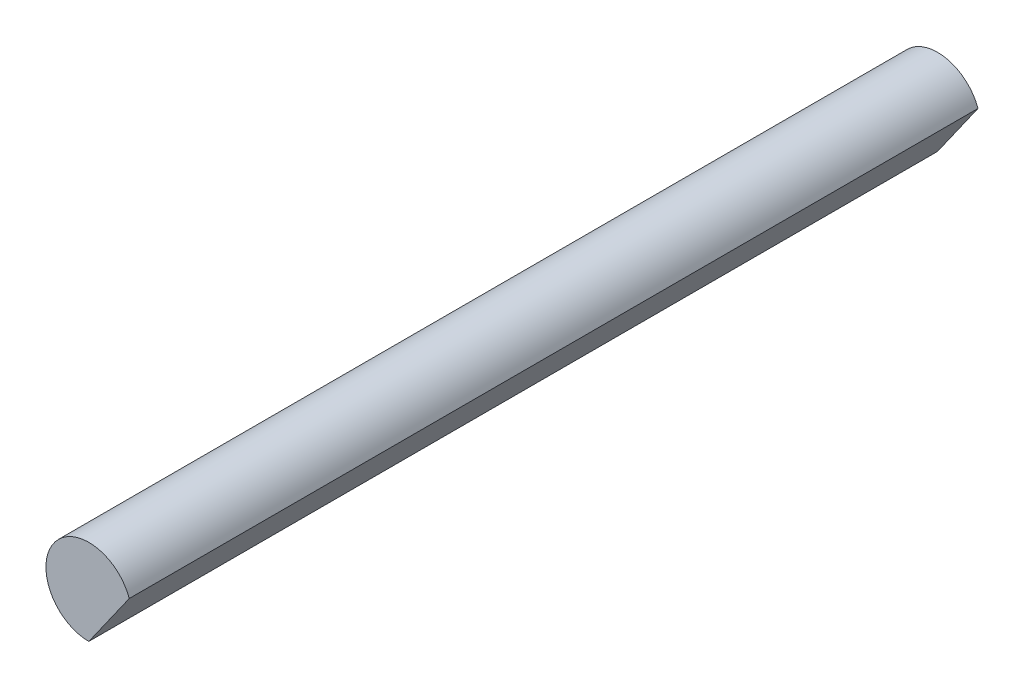
ISO-10303-21;
HEADER;
FILE_DESCRIPTION(('STEP AP214'),'2;1');
FILE_NAME('part.step','',(''),(''),'','','');
FILE_SCHEMA(('AUTOMOTIVE_DESIGN { 1 0 10303 214 1 1 1 1 }'));
ENDSEC;
DATA;
#1=APPLICATION_CONTEXT('core data for automotive mechanical design processes');
#2=APPLICATION_PROTOCOL_DEFINITION('international standard','automotive_design',2000,#1);
#3=PRODUCT_CONTEXT('',#1,'mechanical');
#4=PRODUCT('Part','Part','',(#3));
#5=PRODUCT_RELATED_PRODUCT_CATEGORY('part','',(#4));
#6=PRODUCT_DEFINITION_FORMATION('','',#4);
#7=PRODUCT_DEFINITION_CONTEXT('part definition',#1,'design');
#8=PRODUCT_DEFINITION('design','',#6,#7);
#9=PRODUCT_DEFINITION_SHAPE('','',#8);
#10=(LENGTH_UNIT() NAMED_UNIT(*) SI_UNIT(.MILLI.,.METRE.));
#11=(NAMED_UNIT(*) PLANE_ANGLE_UNIT() SI_UNIT($,.RADIAN.));
#12=(NAMED_UNIT(*) SI_UNIT($,.STERADIAN.) SOLID_ANGLE_UNIT());
#13=UNCERTAINTY_MEASURE_WITH_UNIT(LENGTH_MEASURE(1.E-05),#10,'distance_accuracy_value','');
#14=(GEOMETRIC_REPRESENTATION_CONTEXT(3) GLOBAL_UNCERTAINTY_ASSIGNED_CONTEXT((#13)) GLOBAL_UNIT_ASSIGNED_CONTEXT((#10,
#11,#12)) REPRESENTATION_CONTEXT('',''));
#15=CARTESIAN_POINT('',(0.,0.,0.));
#16=DIRECTION('',(0.,0.,1.));
#17=DIRECTION('',(1.,0.,0.));
#18=AXIS2_PLACEMENT_3D('',#15,#16,#17);
#19=CARTESIAN_POINT('',(0.,0.,33.840801313614));
#20=DIRECTION('',(0.,0.,-1.));
#21=DIRECTION('',(-1.,0.,0.));
#22=AXIS2_PLACEMENT_3D('',#19,#20,#21);
#23=CYLINDRICAL_SURFACE('',#22,1.5);
#24=CARTESIAN_POINT('',(0.,0.,29.66));
#25=DIRECTION('',(0.,0.,1.));
#26=DIRECTION('',(1.,0.,0.));
#27=AXIS2_PLACEMENT_3D('',#24,#25,#26);
#28=CIRCLE('',#27,1.5);
#29=CARTESIAN_POINT('',(1.41189035148846,0.506523084739268,29.66));
#30=VERTEX_POINT('',#29);
#31=CARTESIAN_POINT('',(-0.00170223000694743,-1.49999903413736,29.66));
#32=VERTEX_POINT('',#31);
#33=EDGE_CURVE('E11',#30,#32,#28,.T.);
#34=ORIENTED_EDGE('',*,*,#33,.F.);
#35=DIRECTION('',(0.,0.,-1.));
#36=VECTOR('',#35,1.);
#37=CARTESIAN_POINT('',(1.41189035148846,0.506523084739268,33.840801313614));
#38=LINE('',#37,#36);
#39=CARTESIAN_POINT('',(1.41189035148846,0.506523084739268,0.));
#40=VERTEX_POINT('',#39);
#41=EDGE_CURVE('E41',#30,#40,#38,.T.);
#42=ORIENTED_EDGE('',*,*,#41,.T.);
#43=CARTESIAN_POINT('',(0.,0.,0.));
#44=DIRECTION('',(0.,0.,1.));
#45=DIRECTION('',(1.,0.,0.));
#46=AXIS2_PLACEMENT_3D('',#43,#44,#45);
#47=CIRCLE('',#46,1.5);
#48=CARTESIAN_POINT('',(-0.00170223000694743,-1.49999903413736,0.));
#49=VERTEX_POINT('',#48);
#50=EDGE_CURVE('E66',#40,#49,#47,.T.);
#51=ORIENTED_EDGE('',*,*,#50,.T.);
#52=DIRECTION('',(0.,0.,-1.));
#53=VECTOR('',#52,1.);
#54=CARTESIAN_POINT('',(-0.00170223000694743,-1.49999903413736,33.840801313614));
#55=LINE('',#54,#53);
#56=EDGE_CURVE('E58',#32,#49,#55,.T.);
#57=ORIENTED_EDGE('',*,*,#56,.F.);
#58=EDGE_LOOP('',(#34,#42,#51,#57));
#59=FACE_BOUND('',#58,.T.);
#60=ADVANCED_FACE('F37',(#59),#23,.T.);
#61=CARTESIAN_POINT('',(-0.00170223000694743,-1.49999903413736,33.840801313614));
#62=DIRECTION('',(-0.81750036027914,0.575928086607588,0.));
#63=DIRECTION('',(-0.575928086607588,-0.81750036027914,0.));
#64=AXIS2_PLACEMENT_3D('',#61,#62,#63);
#65=PLANE('',#64);
#66=DIRECTION('',(0.575928086607588,0.81750036027914,0.));
#67=VECTOR('',#66,1.);
#68=CARTESIAN_POINT('',(-0.00170223000694743,-1.49999903413736,29.66));
#69=LINE('',#68,#67);
#70=EDGE_CURVE('E46',#32,#30,#69,.T.);
#71=ORIENTED_EDGE('',*,*,#70,.F.);
#72=ORIENTED_EDGE('',*,*,#56,.T.);
#73=DIRECTION('',(0.575928086607588,0.81750036027914,0.));
#74=VECTOR('',#73,1.);
#75=CARTESIAN_POINT('',(-0.00170223000694743,-1.49999903413736,0.));
#76=LINE('',#75,#74);
#77=EDGE_CURVE('E68',#49,#40,#76,.T.);
#78=ORIENTED_EDGE('',*,*,#77,.T.);
#79=ORIENTED_EDGE('',*,*,#41,.F.);
#80=EDGE_LOOP('',(#71,#72,#78,#79));
#81=FACE_BOUND('',#80,.T.);
#82=ADVANCED_FACE('F69',(#81),#65,.F.);
#83=CARTESIAN_POINT('',(0.,0.,0.));
#84=DIRECTION('',(0.,0.,1.));
#85=DIRECTION('',(1.,0.,0.));
#86=AXIS2_PLACEMENT_3D('',#83,#84,#85);
#87=PLANE('',#86);
#88=ORIENTED_EDGE('',*,*,#50,.F.);
#89=ORIENTED_EDGE('',*,*,#77,.F.);
#90=EDGE_LOOP('',(#88,#89));
#91=FACE_BOUND('',#90,.T.);
#92=ADVANCED_FACE('F72',(#91),#87,.F.);
#93=CARTESIAN_POINT('',(0.,0.,29.66));
#94=DIRECTION('',(0.,0.,1.));
#95=DIRECTION('',(-0.81750036027914,0.575928086607587,0.));
#96=AXIS2_PLACEMENT_3D('',#93,#94,#95);
#97=PLANE('',#96);
#98=ORIENTED_EDGE('',*,*,#70,.T.);
#99=ORIENTED_EDGE('',*,*,#33,.T.);
#100=EDGE_LOOP('',(#98,#99));
#101=FACE_BOUND('',#100,.T.);
#102=ADVANCED_FACE('F39',(#101),#97,.T.);
#103=CLOSED_SHELL('',(#60,#82,#92,#102));
#104=MANIFOLD_SOLID_BREP('B2',#103);
#105=ADVANCED_BREP_SHAPE_REPRESENTATION('',(#18,#104),#14);
#106=SHAPE_DEFINITION_REPRESENTATION(#9,#105);
ENDSEC;
END-ISO-10303-21;
